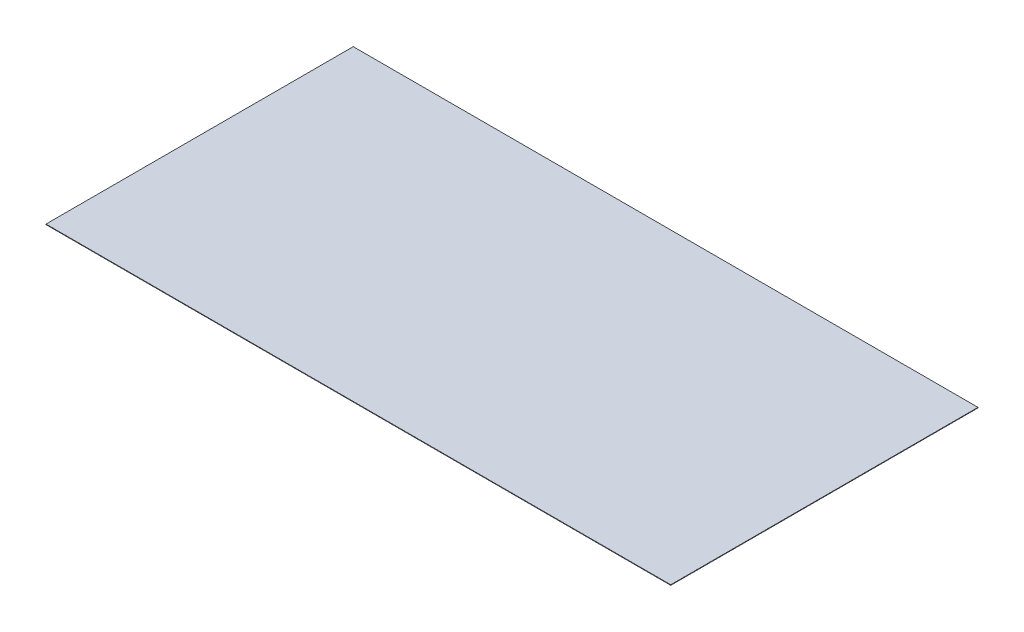
ISO-10303-21;
HEADER;
FILE_DESCRIPTION(('STEP AP214'),'2;1');
FILE_NAME('part.step','',(''),(''),'','','');
FILE_SCHEMA(('AUTOMOTIVE_DESIGN { 1 0 10303 214 1 1 1 1 }'));
ENDSEC;
DATA;
#1=APPLICATION_CONTEXT('core data for automotive mechanical design processes');
#2=APPLICATION_PROTOCOL_DEFINITION('international standard','automotive_design',2000,#1);
#3=PRODUCT_CONTEXT('',#1,'mechanical');
#4=PRODUCT('Part','Part','',(#3));
#5=PRODUCT_RELATED_PRODUCT_CATEGORY('part','',(#4));
#6=PRODUCT_DEFINITION_FORMATION('','',#4);
#7=PRODUCT_DEFINITION_CONTEXT('part definition',#1,'design');
#8=PRODUCT_DEFINITION('design','',#6,#7);
#9=PRODUCT_DEFINITION_SHAPE('','',#8);
#10=(LENGTH_UNIT() NAMED_UNIT(*) SI_UNIT(.MILLI.,.METRE.));
#11=(NAMED_UNIT(*) PLANE_ANGLE_UNIT() SI_UNIT($,.RADIAN.));
#12=(NAMED_UNIT(*) SI_UNIT($,.STERADIAN.) SOLID_ANGLE_UNIT());
#13=UNCERTAINTY_MEASURE_WITH_UNIT(LENGTH_MEASURE(1.E-05),#10,'distance_accuracy_value','');
#14=(GEOMETRIC_REPRESENTATION_CONTEXT(3) GLOBAL_UNCERTAINTY_ASSIGNED_CONTEXT((#13)) GLOBAL_UNIT_ASSIGNED_CONTEXT((#10,
#11,#12)) REPRESENTATION_CONTEXT('',''));
#15=CARTESIAN_POINT('',(0.,0.,0.));
#16=DIRECTION('',(0.,0.,1.));
#17=DIRECTION('',(1.,0.,0.));
#18=AXIS2_PLACEMENT_3D('',#15,#16,#17);
#19=CARTESIAN_POINT('',(1220.,2.,600.));
#20=DIRECTION('',(-1.,0.,0.));
#21=DIRECTION('',(0.,0.,1.));
#22=AXIS2_PLACEMENT_3D('',#19,#20,#21);
#23=PLANE('',#22);
#24=DIRECTION('',(0.,0.,-1.));
#25=VECTOR('',#24,1.);
#26=CARTESIAN_POINT('',(1220.,0.,600.));
#27=LINE('',#26,#25);
#28=CARTESIAN_POINT('',(1220.,0.,600.));
#29=VERTEX_POINT('',#28);
#30=CARTESIAN_POINT('',(1220.,0.,-600.));
#31=VERTEX_POINT('',#30);
#32=EDGE_CURVE('E96',#29,#31,#27,.T.);
#33=ORIENTED_EDGE('',*,*,#32,.T.);
#34=DIRECTION('',(0.,-1.,0.));
#35=VECTOR('',#34,1.);
#36=CARTESIAN_POINT('',(1220.,2.,-600.));
#37=LINE('',#36,#35);
#38=CARTESIAN_POINT('',(1220.,2.,-600.));
#39=VERTEX_POINT('',#38);
#40=EDGE_CURVE('E11',#39,#31,#37,.T.);
#41=ORIENTED_EDGE('',*,*,#40,.F.);
#42=DIRECTION('',(0.,0.,-1.));
#43=VECTOR('',#42,1.);
#44=CARTESIAN_POINT('',(1220.,2.,600.));
#45=LINE('',#44,#43);
#46=CARTESIAN_POINT('',(1220.,2.,600.));
#47=VERTEX_POINT('',#46);
#48=EDGE_CURVE('E84',#47,#39,#45,.T.);
#49=ORIENTED_EDGE('',*,*,#48,.F.);
#50=DIRECTION('',(0.,-1.,0.));
#51=VECTOR('',#50,1.);
#52=CARTESIAN_POINT('',(1220.,2.,600.));
#53=LINE('',#52,#51);
#54=EDGE_CURVE('E92',#47,#29,#53,.T.);
#55=ORIENTED_EDGE('',*,*,#54,.T.);
#56=EDGE_LOOP('',(#33,#41,#49,#55));
#57=FACE_BOUND('',#56,.T.);
#58=ADVANCED_FACE('F33',(#57),#23,.F.);
#59=CARTESIAN_POINT('',(-1220.,2.,-600.));
#60=DIRECTION('',(0.,0.,1.));
#61=DIRECTION('',(1.,0.,0.));
#62=AXIS2_PLACEMENT_3D('',#59,#60,#61);
#63=PLANE('',#62);
#64=DIRECTION('',(-1.,0.,0.));
#65=VECTOR('',#64,1.);
#66=CARTESIAN_POINT('',(-1220.,0.,-600.));
#67=LINE('',#66,#65);
#68=CARTESIAN_POINT('',(-1220.,0.,-600.));
#69=VERTEX_POINT('',#68);
#70=EDGE_CURVE('E88',#31,#69,#67,.T.);
#71=ORIENTED_EDGE('',*,*,#70,.T.);
#72=DIRECTION('',(0.,-1.,0.));
#73=VECTOR('',#72,1.);
#74=CARTESIAN_POINT('',(-1220.,2.,-600.));
#75=LINE('',#74,#73);
#76=CARTESIAN_POINT('',(-1220.,2.,-600.));
#77=VERTEX_POINT('',#76);
#78=EDGE_CURVE('E41',#77,#69,#75,.T.);
#79=ORIENTED_EDGE('',*,*,#78,.F.);
#80=DIRECTION('',(-1.,0.,0.));
#81=VECTOR('',#80,1.);
#82=CARTESIAN_POINT('',(-1220.,2.,-600.));
#83=LINE('',#82,#81);
#84=EDGE_CURVE('E79',#39,#77,#83,.T.);
#85=ORIENTED_EDGE('',*,*,#84,.F.);
#86=ORIENTED_EDGE('',*,*,#40,.T.);
#87=EDGE_LOOP('',(#71,#79,#85,#86));
#88=FACE_BOUND('',#87,.T.);
#89=ADVANCED_FACE('F87',(#88),#63,.F.);
#90=CARTESIAN_POINT('',(-1220.,2.,600.));
#91=DIRECTION('',(1.,0.,0.));
#92=DIRECTION('',(0.,0.,-1.));
#93=AXIS2_PLACEMENT_3D('',#90,#91,#92);
#94=PLANE('',#93);
#95=DIRECTION('',(0.,0.,1.));
#96=VECTOR('',#95,1.);
#97=CARTESIAN_POINT('',(-1220.,0.,600.));
#98=LINE('',#97,#96);
#99=CARTESIAN_POINT('',(-1220.,0.,600.));
#100=VERTEX_POINT('',#99);
#101=EDGE_CURVE('E66',#69,#100,#98,.T.);
#102=ORIENTED_EDGE('',*,*,#101,.T.);
#103=DIRECTION('',(0.,-1.,0.));
#104=VECTOR('',#103,1.);
#105=CARTESIAN_POINT('',(-1220.,2.,600.));
#106=LINE('',#105,#104);
#107=CARTESIAN_POINT('',(-1220.,2.,600.));
#108=VERTEX_POINT('',#107);
#109=EDGE_CURVE('E89',#108,#100,#106,.T.);
#110=ORIENTED_EDGE('',*,*,#109,.F.);
#111=DIRECTION('',(0.,0.,1.));
#112=VECTOR('',#111,1.);
#113=CARTESIAN_POINT('',(-1220.,2.,600.));
#114=LINE('',#113,#112);
#115=EDGE_CURVE('E82',#77,#108,#114,.T.);
#116=ORIENTED_EDGE('',*,*,#115,.F.);
#117=ORIENTED_EDGE('',*,*,#78,.T.);
#118=EDGE_LOOP('',(#102,#110,#116,#117));
#119=FACE_BOUND('',#118,.T.);
#120=ADVANCED_FACE('F90',(#119),#94,.F.);
#121=CARTESIAN_POINT('',(-1220.,2.,600.));
#122=DIRECTION('',(0.,0.,-1.));
#123=DIRECTION('',(-1.,0.,0.));
#124=AXIS2_PLACEMENT_3D('',#121,#122,#123);
#125=PLANE('',#124);
#126=DIRECTION('',(1.,0.,0.));
#127=VECTOR('',#126,1.);
#128=CARTESIAN_POINT('',(-1220.,0.,600.));
#129=LINE('',#128,#127);
#130=EDGE_CURVE('E72',#100,#29,#129,.T.);
#131=ORIENTED_EDGE('',*,*,#130,.T.);
#132=ORIENTED_EDGE('',*,*,#54,.F.);
#133=DIRECTION('',(1.,0.,0.));
#134=VECTOR('',#133,1.);
#135=CARTESIAN_POINT('',(-1220.,2.,600.));
#136=LINE('',#135,#134);
#137=EDGE_CURVE('E49',#108,#47,#136,.T.);
#138=ORIENTED_EDGE('',*,*,#137,.F.);
#139=ORIENTED_EDGE('',*,*,#109,.T.);
#140=EDGE_LOOP('',(#131,#132,#138,#139));
#141=FACE_BOUND('',#140,.T.);
#142=ADVANCED_FACE('F103',(#141),#125,.F.);
#143=CARTESIAN_POINT('',(0.,2.,0.));
#144=DIRECTION('',(0.,-1.,0.));
#145=DIRECTION('',(0.,0.,-1.));
#146=AXIS2_PLACEMENT_3D('',#143,#144,#145);
#147=PLANE('',#146);
#148=ORIENTED_EDGE('',*,*,#48,.T.);
#149=ORIENTED_EDGE('',*,*,#84,.T.);
#150=ORIENTED_EDGE('',*,*,#115,.T.);
#151=ORIENTED_EDGE('',*,*,#137,.T.);
#152=EDGE_LOOP('',(#148,#149,#150,#151));
#153=FACE_BOUND('',#152,.T.);
#154=ADVANCED_FACE('F80',(#153),#147,.F.);
#155=CARTESIAN_POINT('',(0.,0.,0.));
#156=DIRECTION('',(0.,-1.,0.));
#157=DIRECTION('',(0.,0.,-1.));
#158=AXIS2_PLACEMENT_3D('',#155,#156,#157);
#159=PLANE('',#158);
#160=ORIENTED_EDGE('',*,*,#32,.F.);
#161=ORIENTED_EDGE('',*,*,#130,.F.);
#162=ORIENTED_EDGE('',*,*,#101,.F.);
#163=ORIENTED_EDGE('',*,*,#70,.F.);
#164=EDGE_LOOP('',(#160,#161,#162,#163));
#165=FACE_BOUND('',#164,.T.);
#166=ADVANCED_FACE('F106',(#165),#159,.T.);
#167=CLOSED_SHELL('',(#58,#89,#120,#142,#154,#166));
#168=MANIFOLD_SOLID_BREP('B2',#167);
#169=ADVANCED_BREP_SHAPE_REPRESENTATION('',(#18,#168),#14);
#170=SHAPE_DEFINITION_REPRESENTATION(#9,#169);
ENDSEC;
END-ISO-10303-21;
